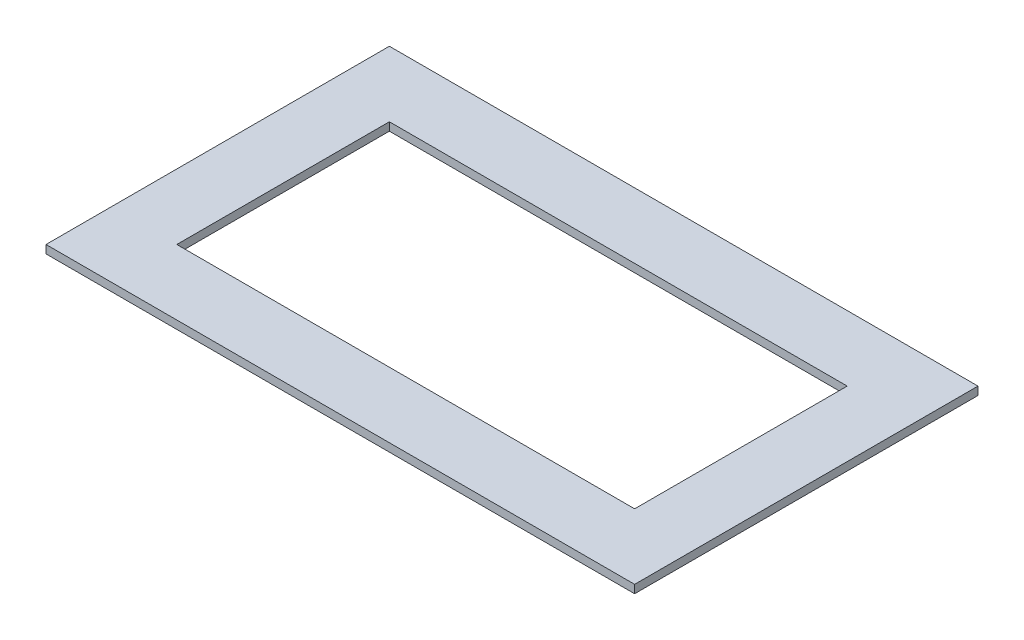
ISO-10303-21;
HEADER;
FILE_DESCRIPTION(('STEP AP214'),'2;1');
FILE_NAME('part.step','',(''),(''),'','','');
FILE_SCHEMA(('AUTOMOTIVE_DESIGN { 1 0 10303 214 1 1 1 1 }'));
ENDSEC;
DATA;
#1=APPLICATION_CONTEXT('core data for automotive mechanical design processes');
#2=APPLICATION_PROTOCOL_DEFINITION('international standard','automotive_design',2000,#1);
#3=PRODUCT_CONTEXT('',#1,'mechanical');
#4=PRODUCT('Part','Part','',(#3));
#5=PRODUCT_RELATED_PRODUCT_CATEGORY('part','',(#4));
#6=PRODUCT_DEFINITION_FORMATION('','',#4);
#7=PRODUCT_DEFINITION_CONTEXT('part definition',#1,'design');
#8=PRODUCT_DEFINITION('design','',#6,#7);
#9=PRODUCT_DEFINITION_SHAPE('','',#8);
#10=(LENGTH_UNIT() NAMED_UNIT(*) SI_UNIT(.MILLI.,.METRE.));
#11=(NAMED_UNIT(*) PLANE_ANGLE_UNIT() SI_UNIT($,.RADIAN.));
#12=(NAMED_UNIT(*) SI_UNIT($,.STERADIAN.) SOLID_ANGLE_UNIT());
#13=UNCERTAINTY_MEASURE_WITH_UNIT(LENGTH_MEASURE(1.E-05),#10,'distance_accuracy_value','');
#14=(GEOMETRIC_REPRESENTATION_CONTEXT(3) GLOBAL_UNCERTAINTY_ASSIGNED_CONTEXT((#13)) GLOBAL_UNIT_ASSIGNED_CONTEXT((#10,
#11,#12)) REPRESENTATION_CONTEXT('',''));
#15=CARTESIAN_POINT('',(0.,0.,0.));
#16=DIRECTION('',(0.,0.,1.));
#17=DIRECTION('',(1.,0.,0.));
#18=AXIS2_PLACEMENT_3D('',#15,#16,#17);
#19=CARTESIAN_POINT('',(0.,5.,0.));
#20=DIRECTION('',(0.,-1.,0.));
#21=DIRECTION('',(0.,0.,-1.));
#22=AXIS2_PLACEMENT_3D('',#19,#20,#21);
#23=PLANE('',#22);
#24=DIRECTION('',(0.,0.,-1.));
#25=VECTOR('',#24,1.);
#26=CARTESIAN_POINT('',(180.,5.,105.));
#27=LINE('',#26,#25);
#28=CARTESIAN_POINT('',(180.,5.,105.));
#29=VERTEX_POINT('',#28);
#30=CARTESIAN_POINT('',(180.,5.,-105.));
#31=VERTEX_POINT('',#30);
#32=EDGE_CURVE('E137',#29,#31,#27,.T.);
#33=ORIENTED_EDGE('',*,*,#32,.T.);
#34=DIRECTION('',(-1.,0.,0.));
#35=VECTOR('',#34,1.);
#36=CARTESIAN_POINT('',(-180.,5.,-105.));
#37=LINE('',#36,#35);
#38=CARTESIAN_POINT('',(-180.,5.,-105.));
#39=VERTEX_POINT('',#38);
#40=EDGE_CURVE('E140',#31,#39,#37,.T.);
#41=ORIENTED_EDGE('',*,*,#40,.T.);
#42=DIRECTION('',(0.,0.,1.));
#43=VECTOR('',#42,1.);
#44=CARTESIAN_POINT('',(-180.,5.,105.));
#45=LINE('',#44,#43);
#46=CARTESIAN_POINT('',(-180.,5.,105.));
#47=VERTEX_POINT('',#46);
#48=EDGE_CURVE('E143',#39,#47,#45,.T.);
#49=ORIENTED_EDGE('',*,*,#48,.T.);
#50=DIRECTION('',(1.,0.,0.));
#51=VECTOR('',#50,1.);
#52=CARTESIAN_POINT('',(-180.,5.,105.));
#53=LINE('',#52,#51);
#54=EDGE_CURVE('E145',#47,#29,#53,.T.);
#55=ORIENTED_EDGE('',*,*,#54,.T.);
#56=EDGE_LOOP('',(#33,#41,#49,#55));
#57=FACE_BOUND('',#56,.T.);
#58=DIRECTION('',(0.,0.,-1.));
#59=VECTOR('',#58,1.);
#60=CARTESIAN_POINT('',(140.,5.,65.));
#61=LINE('',#60,#59);
#62=CARTESIAN_POINT('',(140.,5.,65.));
#63=VERTEX_POINT('',#62);
#64=CARTESIAN_POINT('',(140.,5.,-65.));
#65=VERTEX_POINT('',#64);
#66=EDGE_CURVE('E101',#63,#65,#61,.T.);
#67=ORIENTED_EDGE('',*,*,#66,.F.);
#68=DIRECTION('',(1.,0.,0.));
#69=VECTOR('',#68,1.);
#70=CARTESIAN_POINT('',(-140.,5.,65.));
#71=LINE('',#70,#69);
#72=CARTESIAN_POINT('',(-140.,5.,65.));
#73=VERTEX_POINT('',#72);
#74=EDGE_CURVE('E123',#73,#63,#71,.T.);
#75=ORIENTED_EDGE('',*,*,#74,.F.);
#76=DIRECTION('',(0.,0.,1.));
#77=VECTOR('',#76,1.);
#78=CARTESIAN_POINT('',(-140.,5.,65.));
#79=LINE('',#78,#77);
#80=CARTESIAN_POINT('',(-140.,5.,-65.));
#81=VERTEX_POINT('',#80);
#82=EDGE_CURVE('E121',#81,#73,#79,.T.);
#83=ORIENTED_EDGE('',*,*,#82,.F.);
#84=DIRECTION('',(-1.,0.,0.));
#85=VECTOR('',#84,1.);
#86=CARTESIAN_POINT('',(-140.,5.,-65.));
#87=LINE('',#86,#85);
#88=EDGE_CURVE('E109',#65,#81,#87,.T.);
#89=ORIENTED_EDGE('',*,*,#88,.F.);
#90=EDGE_LOOP('',(#67,#75,#83,#89));
#91=FACE_BOUND('',#90,.T.);
#92=ADVANCED_FACE('F36',(#57,#91),#23,.F.);
#93=CARTESIAN_POINT('',(0.,0.,0.));
#94=DIRECTION('',(0.,-1.,0.));
#95=DIRECTION('',(0.,0.,-1.));
#96=AXIS2_PLACEMENT_3D('',#93,#94,#95);
#97=PLANE('',#96);
#98=DIRECTION('',(0.,0.,-1.));
#99=VECTOR('',#98,1.);
#100=CARTESIAN_POINT('',(180.,0.,105.));
#101=LINE('',#100,#99);
#102=CARTESIAN_POINT('',(180.,0.,105.));
#103=VERTEX_POINT('',#102);
#104=CARTESIAN_POINT('',(180.,0.,-105.));
#105=VERTEX_POINT('',#104);
#106=EDGE_CURVE('E117',#103,#105,#101,.T.);
#107=ORIENTED_EDGE('',*,*,#106,.F.);
#108=DIRECTION('',(1.,0.,0.));
#109=VECTOR('',#108,1.);
#110=CARTESIAN_POINT('',(-180.,0.,105.));
#111=LINE('',#110,#109);
#112=CARTESIAN_POINT('',(-180.,0.,105.));
#113=VERTEX_POINT('',#112);
#114=EDGE_CURVE('E141',#113,#103,#111,.T.);
#115=ORIENTED_EDGE('',*,*,#114,.F.);
#116=DIRECTION('',(0.,0.,1.));
#117=VECTOR('',#116,1.);
#118=CARTESIAN_POINT('',(-180.,0.,105.));
#119=LINE('',#118,#117);
#120=CARTESIAN_POINT('',(-180.,0.,-105.));
#121=VERTEX_POINT('',#120);
#122=EDGE_CURVE('E152',#121,#113,#119,.T.);
#123=ORIENTED_EDGE('',*,*,#122,.F.);
#124=DIRECTION('',(-1.,0.,0.));
#125=VECTOR('',#124,1.);
#126=CARTESIAN_POINT('',(-180.,0.,-105.));
#127=LINE('',#126,#125);
#128=EDGE_CURVE('E150',#105,#121,#127,.T.);
#129=ORIENTED_EDGE('',*,*,#128,.F.);
#130=EDGE_LOOP('',(#107,#115,#123,#129));
#131=FACE_BOUND('',#130,.T.);
#132=DIRECTION('',(1.,0.,0.));
#133=VECTOR('',#132,1.);
#134=CARTESIAN_POINT('',(-140.,0.,65.));
#135=LINE('',#134,#133);
#136=CARTESIAN_POINT('',(-140.,0.,65.));
#137=VERTEX_POINT('',#136);
#138=CARTESIAN_POINT('',(140.,0.,65.));
#139=VERTEX_POINT('',#138);
#140=EDGE_CURVE('E110',#137,#139,#135,.T.);
#141=ORIENTED_EDGE('',*,*,#140,.T.);
#142=DIRECTION('',(0.,0.,-1.));
#143=VECTOR('',#142,1.);
#144=CARTESIAN_POINT('',(140.,0.,65.));
#145=LINE('',#144,#143);
#146=CARTESIAN_POINT('',(140.,0.,-65.));
#147=VERTEX_POINT('',#146);
#148=EDGE_CURVE('E59',#139,#147,#145,.T.);
#149=ORIENTED_EDGE('',*,*,#148,.T.);
#150=DIRECTION('',(-1.,0.,0.));
#151=VECTOR('',#150,1.);
#152=CARTESIAN_POINT('',(-140.,0.,-65.));
#153=LINE('',#152,#151);
#154=CARTESIAN_POINT('',(-140.,0.,-65.));
#155=VERTEX_POINT('',#154);
#156=EDGE_CURVE('E116',#147,#155,#153,.T.);
#157=ORIENTED_EDGE('',*,*,#156,.T.);
#158=DIRECTION('',(0.,0.,1.));
#159=VECTOR('',#158,1.);
#160=CARTESIAN_POINT('',(-140.,0.,65.));
#161=LINE('',#160,#159);
#162=EDGE_CURVE('E129',#155,#137,#161,.T.);
#163=ORIENTED_EDGE('',*,*,#162,.T.);
#164=EDGE_LOOP('',(#141,#149,#157,#163));
#165=FACE_BOUND('',#164,.T.);
#166=ADVANCED_FACE('F170',(#131,#165),#97,.T.);
#167=CARTESIAN_POINT('',(180.,5.,105.));
#168=DIRECTION('',(-1.,0.,0.));
#169=DIRECTION('',(0.,0.,1.));
#170=AXIS2_PLACEMENT_3D('',#167,#168,#169);
#171=PLANE('',#170);
#172=ORIENTED_EDGE('',*,*,#106,.T.);
#173=DIRECTION('',(0.,-1.,0.));
#174=VECTOR('',#173,1.);
#175=CARTESIAN_POINT('',(180.,5.,-105.));
#176=LINE('',#175,#174);
#177=EDGE_CURVE('E11',#31,#105,#176,.T.);
#178=ORIENTED_EDGE('',*,*,#177,.F.);
#179=ORIENTED_EDGE('',*,*,#32,.F.);
#180=DIRECTION('',(0.,-1.,0.));
#181=VECTOR('',#180,1.);
#182=CARTESIAN_POINT('',(180.,5.,105.));
#183=LINE('',#182,#181);
#184=EDGE_CURVE('E147',#29,#103,#183,.T.);
#185=ORIENTED_EDGE('',*,*,#184,.T.);
#186=EDGE_LOOP('',(#172,#178,#179,#185));
#187=FACE_BOUND('',#186,.T.);
#188=ADVANCED_FACE('F38',(#187),#171,.F.);
#189=CARTESIAN_POINT('',(-180.,5.,-105.));
#190=DIRECTION('',(0.,0.,1.));
#191=DIRECTION('',(1.,0.,0.));
#192=AXIS2_PLACEMENT_3D('',#189,#190,#191);
#193=PLANE('',#192);
#194=ORIENTED_EDGE('',*,*,#128,.T.);
#195=DIRECTION('',(0.,-1.,0.));
#196=VECTOR('',#195,1.);
#197=CARTESIAN_POINT('',(-180.,5.,-105.));
#198=LINE('',#197,#196);
#199=EDGE_CURVE('E44',#39,#121,#198,.T.);
#200=ORIENTED_EDGE('',*,*,#199,.F.);
#201=ORIENTED_EDGE('',*,*,#40,.F.);
#202=ORIENTED_EDGE('',*,*,#177,.T.);
#203=EDGE_LOOP('',(#194,#200,#201,#202));
#204=FACE_BOUND('',#203,.T.);
#205=ADVANCED_FACE('F180',(#204),#193,.F.);
#206=CARTESIAN_POINT('',(-180.,5.,105.));
#207=DIRECTION('',(1.,0.,0.));
#208=DIRECTION('',(0.,0.,-1.));
#209=AXIS2_PLACEMENT_3D('',#206,#207,#208);
#210=PLANE('',#209);
#211=ORIENTED_EDGE('',*,*,#122,.T.);
#212=DIRECTION('',(0.,-1.,0.));
#213=VECTOR('',#212,1.);
#214=CARTESIAN_POINT('',(-180.,5.,105.));
#215=LINE('',#214,#213);
#216=EDGE_CURVE('E157',#47,#113,#215,.T.);
#217=ORIENTED_EDGE('',*,*,#216,.F.);
#218=ORIENTED_EDGE('',*,*,#48,.F.);
#219=ORIENTED_EDGE('',*,*,#199,.T.);
#220=EDGE_LOOP('',(#211,#217,#218,#219));
#221=FACE_BOUND('',#220,.T.);
#222=ADVANCED_FACE('F164',(#221),#210,.F.);
#223=CARTESIAN_POINT('',(-180.,5.,105.));
#224=DIRECTION('',(0.,0.,-1.));
#225=DIRECTION('',(-1.,0.,0.));
#226=AXIS2_PLACEMENT_3D('',#223,#224,#225);
#227=PLANE('',#226);
#228=ORIENTED_EDGE('',*,*,#114,.T.);
#229=ORIENTED_EDGE('',*,*,#184,.F.);
#230=ORIENTED_EDGE('',*,*,#54,.F.);
#231=ORIENTED_EDGE('',*,*,#216,.T.);
#232=EDGE_LOOP('',(#228,#229,#230,#231));
#233=FACE_BOUND('',#232,.T.);
#234=ADVANCED_FACE('F174',(#233),#227,.F.);
#235=CARTESIAN_POINT('',(140.,5.,65.));
#236=DIRECTION('',(-1.,0.,0.));
#237=DIRECTION('',(0.,0.,1.));
#238=AXIS2_PLACEMENT_3D('',#235,#236,#237);
#239=PLANE('',#238);
#240=ORIENTED_EDGE('',*,*,#148,.F.);
#241=DIRECTION('',(0.,-1.,0.));
#242=VECTOR('',#241,1.);
#243=CARTESIAN_POINT('',(140.,5.,65.));
#244=LINE('',#243,#242);
#245=EDGE_CURVE('E105',#63,#139,#244,.T.);
#246=ORIENTED_EDGE('',*,*,#245,.F.);
#247=ORIENTED_EDGE('',*,*,#66,.T.);
#248=DIRECTION('',(0.,-1.,0.));
#249=VECTOR('',#248,1.);
#250=CARTESIAN_POINT('',(140.,5.,-65.));
#251=LINE('',#250,#249);
#252=EDGE_CURVE('E104',#65,#147,#251,.T.);
#253=ORIENTED_EDGE('',*,*,#252,.T.);
#254=EDGE_LOOP('',(#240,#246,#247,#253));
#255=FACE_BOUND('',#254,.T.);
#256=ADVANCED_FACE('F103',(#255),#239,.T.);
#257=CARTESIAN_POINT('',(-140.,5.,-65.));
#258=DIRECTION('',(0.,0.,1.));
#259=DIRECTION('',(1.,0.,0.));
#260=AXIS2_PLACEMENT_3D('',#257,#258,#259);
#261=PLANE('',#260);
#262=ORIENTED_EDGE('',*,*,#156,.F.);
#263=ORIENTED_EDGE('',*,*,#252,.F.);
#264=ORIENTED_EDGE('',*,*,#88,.T.);
#265=DIRECTION('',(0.,-1.,0.));
#266=VECTOR('',#265,1.);
#267=CARTESIAN_POINT('',(-140.,5.,-65.));
#268=LINE('',#267,#266);
#269=EDGE_CURVE('E118',#81,#155,#268,.T.);
#270=ORIENTED_EDGE('',*,*,#269,.T.);
#271=EDGE_LOOP('',(#262,#263,#264,#270));
#272=FACE_BOUND('',#271,.T.);
#273=ADVANCED_FACE('F113',(#272),#261,.T.);
#274=CARTESIAN_POINT('',(-140.,5.,65.));
#275=DIRECTION('',(1.,0.,0.));
#276=DIRECTION('',(0.,0.,-1.));
#277=AXIS2_PLACEMENT_3D('',#274,#275,#276);
#278=PLANE('',#277);
#279=ORIENTED_EDGE('',*,*,#162,.F.);
#280=ORIENTED_EDGE('',*,*,#269,.F.);
#281=ORIENTED_EDGE('',*,*,#82,.T.);
#282=DIRECTION('',(0.,-1.,0.));
#283=VECTOR('',#282,1.);
#284=CARTESIAN_POINT('',(-140.,5.,65.));
#285=LINE('',#284,#283);
#286=EDGE_CURVE('E51',#73,#137,#285,.T.);
#287=ORIENTED_EDGE('',*,*,#286,.T.);
#288=EDGE_LOOP('',(#279,#280,#281,#287));
#289=FACE_BOUND('',#288,.T.);
#290=ADVANCED_FACE('F203',(#289),#278,.T.);
#291=CARTESIAN_POINT('',(-140.,5.,65.));
#292=DIRECTION('',(0.,0.,-1.));
#293=DIRECTION('',(-1.,0.,0.));
#294=AXIS2_PLACEMENT_3D('',#291,#292,#293);
#295=PLANE('',#294);
#296=ORIENTED_EDGE('',*,*,#140,.F.);
#297=ORIENTED_EDGE('',*,*,#286,.F.);
#298=ORIENTED_EDGE('',*,*,#74,.T.);
#299=ORIENTED_EDGE('',*,*,#245,.T.);
#300=EDGE_LOOP('',(#296,#297,#298,#299));
#301=FACE_BOUND('',#300,.T.);
#302=ADVANCED_FACE('F207',(#301),#295,.T.);
#303=CLOSED_SHELL('',(#92,#166,#188,#205,#222,#234,#256,#273,#290,#302));
#304=MANIFOLD_SOLID_BREP('B2',#303);
#305=ADVANCED_BREP_SHAPE_REPRESENTATION('',(#18,#304),#14);
#306=SHAPE_DEFINITION_REPRESENTATION(#9,#305);
ENDSEC;
END-ISO-10303-21;
